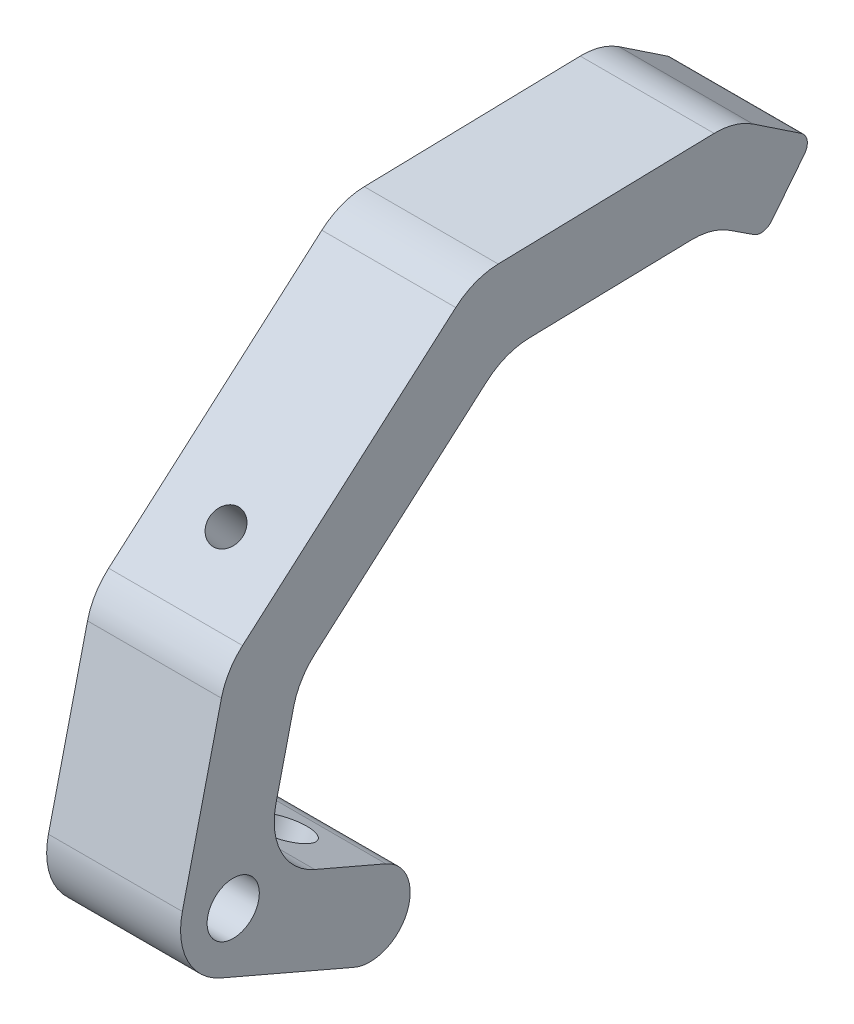
ISO-10303-21;
HEADER;
FILE_DESCRIPTION(('STEP AP214'),'2;1');
FILE_NAME('part.step','',(''),(''),'','','');
FILE_SCHEMA(('AUTOMOTIVE_DESIGN { 1 0 10303 214 1 1 1 1 }'));
ENDSEC;
DATA;
#1=APPLICATION_CONTEXT('core data for automotive mechanical design processes');
#2=APPLICATION_PROTOCOL_DEFINITION('international standard','automotive_design',2000,#1);
#3=PRODUCT_CONTEXT('',#1,'mechanical');
#4=PRODUCT('Part','Part','',(#3));
#5=PRODUCT_RELATED_PRODUCT_CATEGORY('part','',(#4));
#6=PRODUCT_DEFINITION_FORMATION('','',#4);
#7=PRODUCT_DEFINITION_CONTEXT('part definition',#1,'design');
#8=PRODUCT_DEFINITION('design','',#6,#7);
#9=PRODUCT_DEFINITION_SHAPE('','',#8);
#10=(LENGTH_UNIT() NAMED_UNIT(*) SI_UNIT(.MILLI.,.METRE.));
#11=(NAMED_UNIT(*) PLANE_ANGLE_UNIT() SI_UNIT($,.RADIAN.));
#12=(NAMED_UNIT(*) SI_UNIT($,.STERADIAN.) SOLID_ANGLE_UNIT());
#13=UNCERTAINTY_MEASURE_WITH_UNIT(LENGTH_MEASURE(1.E-05),#10,'distance_accuracy_value','');
#14=(GEOMETRIC_REPRESENTATION_CONTEXT(3) GLOBAL_UNCERTAINTY_ASSIGNED_CONTEXT((#13)) GLOBAL_UNIT_ASSIGNED_CONTEXT((#10,
#11,#12)) REPRESENTATION_CONTEXT('',''));
#15=CARTESIAN_POINT('',(0.,0.,0.));
#16=DIRECTION('',(0.,0.,1.));
#17=DIRECTION('',(1.,0.,0.));
#18=AXIS2_PLACEMENT_3D('',#15,#16,#17);
#19=CARTESIAN_POINT('',(25.4,-12.5585958310369,-29.1606613565719));
#20=DIRECTION('',(1.,0.,0.));
#21=DIRECTION('',(0.,0.,-1.));
#22=AXIS2_PLACEMENT_3D('',#19,#20,#21);
#23=PLANE('',#22);
#24=DIRECTION('',(0.,0.784049578849824,-0.620698201951169));
#25=VECTOR('',#24,1.);
#26=CARTESIAN_POINT('',(25.4,61.637766496689,-103.90188664107));
#27=LINE('',#26,#25);
#28=CARTESIAN_POINT('',(25.4,63.4548561776263,-105.340398092599));
#29=VERTEX_POINT('',#28);
#30=CARTESIAN_POINT('',(25.4,71.3247294522191,-111.570636999543));
#31=VERTEX_POINT('',#30);
#32=EDGE_CURVE('E244',#29,#31,#27,.T.);
#33=ORIENTED_EDGE('',*,*,#32,.T.);
#34=CARTESIAN_POINT('',(25.4,72.9013028851751,-109.579151069265));
#35=DIRECTION('',(1.,0.,0.));
#36=DIRECTION('',(0.,0.,-1.));
#37=AXIS2_PLACEMENT_3D('',#34,#35,#36);
#38=CIRCLE('',#37,2.54);
#39=CARTESIAN_POINT('',(25.4,75.0132522862397,-110.990274638391));
#40=VERTEX_POINT('',#39);
#41=EDGE_CURVE('E50',#31,#40,#38,.T.);
#42=ORIENTED_EDGE('',*,*,#41,.T.);
#43=DIRECTION('',(0.,0.555560460285814,0.831476142151424));
#44=VECTOR('',#43,1.);
#45=CARTESIAN_POINT('',(25.4,83.3912767020047,-98.451355982288));
#46=LINE('',#45,#44);
#47=CARTESIAN_POINT('',(25.4,81.1592530919545,-101.791900375099));
#48=VERTEX_POINT('',#47);
#49=EDGE_CURVE('E290',#40,#48,#46,.T.);
#50=ORIENTED_EDGE('',*,*,#49,.T.);
#51=CARTESIAN_POINT('',(25.4,70.5995060866314,-94.7362825294694));
#52=DIRECTION('',(1.,0.,0.));
#53=DIRECTION('',(0.,0.,-1.));
#54=AXIS2_PLACEMENT_3D('',#51,#52,#53);
#55=CIRCLE('',#54,12.7);
#56=CARTESIAN_POINT('',(25.4,83.2959290802973,-94.4348805289583));
#57=VERTEX_POINT('',#56);
#58=EDGE_CURVE('E335',#48,#57,#55,.T.);
#59=ORIENTED_EDGE('',*,*,#58,.T.);
#60=DIRECTION('',(0.,-0.0237324409851219,0.999718345957944));
#61=VECTOR('',#60,1.);
#62=CARTESIAN_POINT('',(25.4,82.2145560500137,-48.8825305673002));
#63=LINE('',#62,#61);
#64=CARTESIAN_POINT('',(25.4,82.3235432258102,-53.473566069559));
#65=VERTEX_POINT('',#64);
#66=EDGE_CURVE('E425',#57,#65,#63,.T.);
#67=ORIENTED_EDGE('',*,*,#66,.T.);
#68=CARTESIAN_POINT('',(25.4,69.6271202321443,-53.7749680700701));
#69=DIRECTION('',(1.,0.,0.));
#70=DIRECTION('',(0.,0.,-1.));
#71=AXIS2_PLACEMENT_3D('',#68,#69,#70);
#72=CIRCLE('',#71,12.7);
#73=CARTESIAN_POINT('',(25.4,79.194467979766,-45.4229708792133));
#74=VERTEX_POINT('',#73);
#75=EDGE_CURVE('E332',#65,#74,#72,.T.);
#76=ORIENTED_EDGE('',*,*,#75,.T.);
#77=DIRECTION('',(0.,-0.65763757408321,0.753334468316664));
#78=VECTOR('',#77,1.);
#79=CARTESIAN_POINT('',(25.4,41.2105608090452,-1.91179140785317));
#80=LINE('',#79,#78);
#81=CARTESIAN_POINT('',(25.4,43.8904858756525,-4.98168887834908));
#82=VERTEX_POINT('',#81);
#83=EDGE_CURVE('E532',#74,#82,#80,.T.);
#84=ORIENTED_EDGE('',*,*,#83,.T.);
#85=CARTESIAN_POINT('',(25.4,34.3231381280309,-13.3336860692058));
#86=DIRECTION('',(1.,0.,0.));
#87=DIRECTION('',(0.,0.,-1.));
#88=AXIS2_PLACEMENT_3D('',#85,#86,#87);
#89=CIRCLE('',#88,12.7);
#90=CARTESIAN_POINT('',(25.4,37.2447808629191,-0.974317002393628));
#91=VERTEX_POINT('',#90);
#92=EDGE_CURVE('E329',#82,#91,#89,.T.);
#93=ORIENTED_EDGE('',*,*,#92,.T.);
#94=DIRECTION('',(0.,-0.973178666678127,0.23005060904632));
#95=VECTOR('',#94,1.);
#96=CARTESIAN_POINT('',(25.4,-4.46945957439463,8.88655104485323));
#97=LINE('',#96,#95);
#98=CARTESIAN_POINT('',(25.4,5.90128245115134,6.43500170357673));
#99=VERTEX_POINT('',#98);
#100=EDGE_CURVE('E206',#91,#99,#97,.T.);
#101=ORIENTED_EDGE('',*,*,#100,.T.);
#102=CARTESIAN_POINT('',(25.4,2.97963971626309,-5.92436736323549));
#103=DIRECTION('',(1.,0.,0.));
#104=DIRECTION('',(0.,0.,-1.));
#105=AXIS2_PLACEMENT_3D('',#102,#103,#104);
#106=CIRCLE('',#105,12.7);
#107=CARTESIAN_POINT('',(25.4,-8.68462482636565,-0.90092903082073));
#108=VERTEX_POINT('',#107);
#109=EDGE_CURVE('E201',#99,#108,#106,.T.);
#110=ORIENTED_EDGE('',*,*,#109,.T.);
#111=DIRECTION('',(0.,-0.395546325386989,-0.918446026978641));
#112=VECTOR('',#111,1.);
#113=CARTESIAN_POINT('',(25.4,-4.46945957439463,8.88655104485323));
#114=LINE('',#113,#112);
#115=CARTESIAN_POINT('',(25.4,-19.5571545566141,-26.146598357123));
#116=VERTEX_POINT('',#115);
#117=EDGE_CURVE('E192',#108,#116,#114,.T.);
#118=ORIENTED_EDGE('',*,*,#117,.T.);
#119=CARTESIAN_POINT('',(25.4,-12.5585958310369,-29.1606613565719));
#120=DIRECTION('',(1.,0.,0.));
#121=DIRECTION('',(0.,0.,-1.));
#122=AXIS2_PLACEMENT_3D('',#119,#120,#121);
#123=CIRCLE('',#122,7.62);
#124=CARTESIAN_POINT('',(25.4,-5.56003710545966,-32.1747243560207));
#125=VERTEX_POINT('',#124);
#126=EDGE_CURVE('E197',#116,#125,#123,.T.);
#127=ORIENTED_EDGE('',*,*,#126,.T.);
#128=DIRECTION('',(0.,0.395546325386989,0.918446026978641));
#129=VECTOR('',#128,1.);
#130=CARTESIAN_POINT('',(25.4,4.46945957439463,-8.88655104485323));
#131=LINE('',#130,#129);
#132=CARTESIAN_POINT('',(25.4,0.25429432242361,-18.6740311205272));
#133=VERTEX_POINT('',#132);
#134=EDGE_CURVE('E223',#125,#133,#131,.T.);
#135=ORIENTED_EDGE('',*,*,#134,.T.);
#136=CARTESIAN_POINT('',(25.4,11.9185588650523,-23.697469452942));
#137=DIRECTION('',(1.,0.,0.));
#138=DIRECTION('',(0.,0.,-1.));
#139=AXIS2_PLACEMENT_3D('',#136,#137,#138);
#140=CIRCLE('',#139,12.7);
#141=CARTESIAN_POINT('',(25.4,14.8402015999406,-11.3381003861297));
#142=VERTEX_POINT('',#141);
#143=EDGE_CURVE('E393',#133,#142,#140,.F.);
#144=ORIENTED_EDGE('',*,*,#143,.T.);
#145=DIRECTION('',(0.,0.973178666678127,-0.230050609046319));
#146=VECTOR('',#145,1.);
#147=CARTESIAN_POINT('',(25.4,4.46945957439463,-8.88655104485323));
#148=LINE('',#147,#146);
#149=CARTESIAN_POINT('',(25.4,28.979873645702,-14.6805905960168));
#150=VERTEX_POINT('',#149);
#151=EDGE_CURVE('E226',#142,#150,#148,.T.);
#152=ORIENTED_EDGE('',*,*,#151,.T.);
#153=CARTESIAN_POINT('',(25.4,26.0582309108137,-27.0399596628291));
#154=DIRECTION('',(1.,0.,0.));
#155=DIRECTION('',(0.,0.,-1.));
#156=AXIS2_PLACEMENT_3D('',#153,#154,#155);
#157=CIRCLE('',#156,12.7);
#158=CARTESIAN_POINT('',(25.4,35.6255786584354,-18.6879624719723));
#159=VERTEX_POINT('',#158);
#160=EDGE_CURVE('E387',#150,#159,#157,.F.);
#161=ORIENTED_EDGE('',*,*,#160,.T.);
#162=DIRECTION('',(0.,0.65763757408321,-0.753334468316664));
#163=VECTOR('',#162,1.);
#164=CARTESIAN_POINT('',(25.4,32.945653591828,-15.6180650014764));
#165=LINE('',#164,#163);
#166=CARTESIAN_POINT('',(25.4,64.0895449983228,-51.2938958825371));
#167=VERTEX_POINT('',#166);
#168=EDGE_CURVE('E233',#159,#167,#165,.T.);
#169=ORIENTED_EDGE('',*,*,#168,.T.);
#170=CARTESIAN_POINT('',(25.4,54.5221972507011,-59.6458930733938));
#171=DIRECTION('',(1.,0.,0.));
#172=DIRECTION('',(0.,0.,-1.));
#173=AXIS2_PLACEMENT_3D('',#170,#171,#172);
#174=CIRCLE('',#173,12.7);
#175=CARTESIAN_POINT('',(25.4,67.218620244367,-59.3444910728828));
#176=VERTEX_POINT('',#175);
#177=EDGE_CURVE('E381',#167,#176,#174,.F.);
#178=ORIENTED_EDGE('',*,*,#177,.T.);
#179=DIRECTION('',(0.,0.0237324409851224,-0.999718345957944));
#180=VECTOR('',#179,1.);
#181=CARTESIAN_POINT('',(25.4,67.1096330685705,-54.753455570624));
#182=LINE('',#181,#180);
#183=CARTESIAN_POINT('',(25.4,67.9497805882237,-90.1442899662488));
#184=VERTEX_POINT('',#183);
#185=EDGE_CURVE('E237',#176,#184,#182,.T.);
#186=ORIENTED_EDGE('',*,*,#185,.T.);
#187=CARTESIAN_POINT('',(25.4,55.2533575945578,-90.4456919667599));
#188=DIRECTION('',(1.,0.,0.));
#189=DIRECTION('',(0.,0.,-1.));
#190=AXIS2_PLACEMENT_3D('',#187,#188,#189);
#191=CIRCLE('',#190,12.7);
#192=CARTESIAN_POINT('',(25.4,65.8895268550452,-97.3855697367399));
#193=VERTEX_POINT('',#192);
#194=EDGE_CURVE('E375',#184,#193,#191,.F.);
#195=ORIENTED_EDGE('',*,*,#194,.T.);
#196=DIRECTION('',(0.,-0.546447068502364,-0.837493642558063));
#197=VECTOR('',#196,1.);
#198=CARTESIAN_POINT('',(25.4,68.0433208252155,-94.0846301556363));
#199=LINE('',#198,#197);
#200=CARTESIAN_POINT('',(25.4,62.9041957584848,-101.960936608324));
#201=VERTEX_POINT('',#200);
#202=EDGE_CURVE('E241',#193,#201,#199,.T.);
#203=ORIENTED_EDGE('',*,*,#202,.T.);
#204=CARTESIAN_POINT('',(25.4,65.0314296105823,-103.34891216232));
#205=DIRECTION('',(1.,0.,0.));
#206=DIRECTION('',(0.,0.,-1.));
#207=AXIS2_PLACEMENT_3D('',#204,#205,#206);
#208=CIRCLE('',#207,2.54);
#209=EDGE_CURVE('E412',#201,#29,#208,.T.);
#210=ORIENTED_EDGE('',*,*,#209,.T.);
#211=EDGE_LOOP('',(#33,#42,#50,#59,#67,#76,#84,#93,#101,#110,#118,#127,#135,#144,#152,#161,#169,
#178,#186,#195,#203,#210));
#212=FACE_BOUND('',#211,.T.);
#213=CARTESIAN_POINT('',(25.4,1.61628901546969,-3.21364017285075));
#214=DIRECTION('',(1.,0.,0.));
#215=DIRECTION('',(0.,0.,-1.));
#216=AXIS2_PLACEMENT_3D('',#213,#214,#215);
#217=CIRCLE('',#216,4.953);
#218=CARTESIAN_POINT('',(25.4,1.61628901546969,-8.16664017285075));
#219=VERTEX_POINT('',#218);
#220=EDGE_CURVE('E251',#219,#219,#217,.T.);
#221=ORIENTED_EDGE('',*,*,#220,.F.);
#222=EDGE_LOOP('',(#221));
#223=FACE_BOUND('',#222,.T.);
#224=ADVANCED_FACE('F41',(#212,#223),#23,.T.);
#225=CARTESIAN_POINT('',(0.,-12.5585958310369,-29.1606613565719));
#226=DIRECTION('',(1.,0.,0.));
#227=DIRECTION('',(0.,0.,-1.));
#228=AXIS2_PLACEMENT_3D('',#225,#226,#227);
#229=PLANE('',#228);
#230=DIRECTION('',(0.,0.555560460285814,0.831476142151424));
#231=VECTOR('',#230,1.);
#232=CARTESIAN_POINT('',(0.,83.3912767020047,-98.451355982288));
#233=LINE('',#232,#231);
#234=CARTESIAN_POINT('',(0.,75.0132522862397,-110.990274638391));
#235=VERTEX_POINT('',#234);
#236=CARTESIAN_POINT('',(0.,81.1592530919545,-101.791900375099));
#237=VERTEX_POINT('',#236);
#238=EDGE_CURVE('E247',#235,#237,#233,.T.);
#239=ORIENTED_EDGE('',*,*,#238,.F.);
#240=CARTESIAN_POINT('',(0.,72.9013028851751,-109.579151069265));
#241=DIRECTION('',(1.,0.,0.));
#242=DIRECTION('',(0.,0.,-1.));
#243=AXIS2_PLACEMENT_3D('',#240,#241,#242);
#244=CIRCLE('',#243,2.54);
#245=CARTESIAN_POINT('',(0.,71.3247294522191,-111.570636999543));
#246=VERTEX_POINT('',#245);
#247=EDGE_CURVE('E403',#235,#246,#244,.F.);
#248=ORIENTED_EDGE('',*,*,#247,.T.);
#249=DIRECTION('',(0.,0.784049578849824,-0.620698201951169));
#250=VECTOR('',#249,1.);
#251=CARTESIAN_POINT('',(0.,61.637766496689,-103.90188664107));
#252=LINE('',#251,#250);
#253=CARTESIAN_POINT('',(0.,63.4548561776263,-105.340398092599));
#254=VERTEX_POINT('',#253);
#255=EDGE_CURVE('E287',#254,#246,#252,.T.);
#256=ORIENTED_EDGE('',*,*,#255,.F.);
#257=CARTESIAN_POINT('',(0.,65.0314296105823,-103.34891216232));
#258=DIRECTION('',(1.,0.,0.));
#259=DIRECTION('',(0.,0.,-1.));
#260=AXIS2_PLACEMENT_3D('',#257,#258,#259);
#261=CIRCLE('',#260,2.54);
#262=CARTESIAN_POINT('',(0.,62.9041957584848,-101.960936608324));
#263=VERTEX_POINT('',#262);
#264=EDGE_CURVE('E400',#254,#263,#261,.F.);
#265=ORIENTED_EDGE('',*,*,#264,.T.);
#266=DIRECTION('',(0.,-0.546447068502364,-0.837493642558063));
#267=VECTOR('',#266,1.);
#268=CARTESIAN_POINT('',(0.,68.0433208252155,-94.0846301556363));
#269=LINE('',#268,#267);
#270=CARTESIAN_POINT('',(0.,65.8895268550452,-97.3855697367399));
#271=VERTEX_POINT('',#270);
#272=EDGE_CURVE('E284',#271,#263,#269,.T.);
#273=ORIENTED_EDGE('',*,*,#272,.F.);
#274=CARTESIAN_POINT('',(0.,55.2533575945578,-90.4456919667599));
#275=DIRECTION('',(1.,0.,0.));
#276=DIRECTION('',(0.,0.,-1.));
#277=AXIS2_PLACEMENT_3D('',#274,#275,#276);
#278=CIRCLE('',#277,12.7);
#279=CARTESIAN_POINT('',(0.,67.9497805882237,-90.1442899662488));
#280=VERTEX_POINT('',#279);
#281=EDGE_CURVE('E372',#271,#280,#278,.T.);
#282=ORIENTED_EDGE('',*,*,#281,.T.);
#283=DIRECTION('',(0.,0.0237324409851224,-0.999718345957944));
#284=VECTOR('',#283,1.);
#285=CARTESIAN_POINT('',(0.,67.1096330685705,-54.753455570624));
#286=LINE('',#285,#284);
#287=CARTESIAN_POINT('',(0.,67.218620244367,-59.3444910728828));
#288=VERTEX_POINT('',#287);
#289=EDGE_CURVE('E280',#288,#280,#286,.T.);
#290=ORIENTED_EDGE('',*,*,#289,.F.);
#291=CARTESIAN_POINT('',(0.,54.5221972507011,-59.6458930733938));
#292=DIRECTION('',(1.,0.,0.));
#293=DIRECTION('',(0.,0.,-1.));
#294=AXIS2_PLACEMENT_3D('',#291,#292,#293);
#295=CIRCLE('',#294,12.7);
#296=CARTESIAN_POINT('',(0.,64.0895449983228,-51.2938958825371));
#297=VERTEX_POINT('',#296);
#298=EDGE_CURVE('E378',#288,#297,#295,.T.);
#299=ORIENTED_EDGE('',*,*,#298,.T.);
#300=DIRECTION('',(0.,0.65763757408321,-0.753334468316664));
#301=VECTOR('',#300,1.);
#302=CARTESIAN_POINT('',(0.,32.945653591828,-15.6180650014764));
#303=LINE('',#302,#301);
#304=CARTESIAN_POINT('',(0.,35.6255786584354,-18.6879624719723));
#305=VERTEX_POINT('',#304);
#306=EDGE_CURVE('E276',#305,#297,#303,.T.);
#307=ORIENTED_EDGE('',*,*,#306,.F.);
#308=CARTESIAN_POINT('',(0.,26.0582309108137,-27.0399596628291));
#309=DIRECTION('',(1.,0.,0.));
#310=DIRECTION('',(0.,0.,-1.));
#311=AXIS2_PLACEMENT_3D('',#308,#309,#310);
#312=CIRCLE('',#311,12.7);
#313=CARTESIAN_POINT('',(0.,28.979873645702,-14.6805905960168));
#314=VERTEX_POINT('',#313);
#315=EDGE_CURVE('E384',#305,#314,#312,.T.);
#316=ORIENTED_EDGE('',*,*,#315,.T.);
#317=DIRECTION('',(0.,0.973178666678127,-0.230050609046319));
#318=VECTOR('',#317,1.);
#319=CARTESIAN_POINT('',(0.,4.46945957439463,-8.88655104485323));
#320=LINE('',#319,#318);
#321=CARTESIAN_POINT('',(0.,14.8402015999406,-11.3381003861297));
#322=VERTEX_POINT('',#321);
#323=EDGE_CURVE('E272',#322,#314,#320,.T.);
#324=ORIENTED_EDGE('',*,*,#323,.F.);
#325=CARTESIAN_POINT('',(0.,11.9185588650523,-23.697469452942));
#326=DIRECTION('',(1.,0.,0.));
#327=DIRECTION('',(0.,0.,-1.));
#328=AXIS2_PLACEMENT_3D('',#325,#326,#327);
#329=CIRCLE('',#328,12.7);
#330=CARTESIAN_POINT('',(0.,0.25429432242361,-18.6740311205272));
#331=VERTEX_POINT('',#330);
#332=EDGE_CURVE('E390',#322,#331,#329,.T.);
#333=ORIENTED_EDGE('',*,*,#332,.T.);
#334=DIRECTION('',(0.,0.395546325386989,0.918446026978641));
#335=VECTOR('',#334,1.);
#336=CARTESIAN_POINT('',(0.,4.46945957439463,-8.88655104485323));
#337=LINE('',#336,#335);
#338=CARTESIAN_POINT('',(0.,-5.56003710545966,-32.1747243560207));
#339=VERTEX_POINT('',#338);
#340=EDGE_CURVE('E268',#339,#331,#337,.T.);
#341=ORIENTED_EDGE('',*,*,#340,.F.);
#342=CARTESIAN_POINT('',(0.,-12.5585958310369,-29.1606613565719));
#343=DIRECTION('',(1.,0.,0.));
#344=DIRECTION('',(0.,0.,-1.));
#345=AXIS2_PLACEMENT_3D('',#342,#343,#344);
#346=CIRCLE('',#345,7.62);
#347=CARTESIAN_POINT('',(0.,-19.5571545566141,-26.146598357123));
#348=VERTEX_POINT('',#347);
#349=EDGE_CURVE('E265',#348,#339,#346,.T.);
#350=ORIENTED_EDGE('',*,*,#349,.F.);
#351=DIRECTION('',(0.,-0.395546325386989,-0.918446026978641));
#352=VECTOR('',#351,1.);
#353=CARTESIAN_POINT('',(0.,-4.46945957439463,8.88655104485323));
#354=LINE('',#353,#352);
#355=CARTESIAN_POINT('',(0.,-8.68462482636565,-0.90092903082073));
#356=VERTEX_POINT('',#355);
#357=EDGE_CURVE('E212',#356,#348,#354,.T.);
#358=ORIENTED_EDGE('',*,*,#357,.F.);
#359=CARTESIAN_POINT('',(0.,2.97963971626309,-5.92436736323549));
#360=DIRECTION('',(1.,0.,0.));
#361=DIRECTION('',(0.,0.,-1.));
#362=AXIS2_PLACEMENT_3D('',#359,#360,#361);
#363=CIRCLE('',#362,12.7);
#364=CARTESIAN_POINT('',(0.,5.90128245115134,6.43500170357673));
#365=VERTEX_POINT('',#364);
#366=EDGE_CURVE('E310',#356,#365,#363,.F.);
#367=ORIENTED_EDGE('',*,*,#366,.T.);
#368=DIRECTION('',(0.,-0.973178666678127,0.23005060904632));
#369=VECTOR('',#368,1.);
#370=CARTESIAN_POINT('',(0.,-4.46945957439463,8.88655104485323));
#371=LINE('',#370,#369);
#372=CARTESIAN_POINT('',(0.,37.2447808629191,-0.974317002393628));
#373=VERTEX_POINT('',#372);
#374=EDGE_CURVE('E259',#373,#365,#371,.T.);
#375=ORIENTED_EDGE('',*,*,#374,.F.);
#376=CARTESIAN_POINT('',(0.,34.3231381280309,-13.3336860692058));
#377=DIRECTION('',(1.,0.,0.));
#378=DIRECTION('',(0.,0.,-1.));
#379=AXIS2_PLACEMENT_3D('',#376,#377,#378);
#380=CIRCLE('',#379,12.7);
#381=CARTESIAN_POINT('',(0.,43.8904858756525,-4.98168887834908));
#382=VERTEX_POINT('',#381);
#383=EDGE_CURVE('E313',#373,#382,#380,.F.);
#384=ORIENTED_EDGE('',*,*,#383,.T.);
#385=DIRECTION('',(0.,-0.65763757408321,0.753334468316664));
#386=VECTOR('',#385,1.);
#387=CARTESIAN_POINT('',(0.,41.2105608090452,-1.91179140785317));
#388=LINE('',#387,#386);
#389=CARTESIAN_POINT('',(0.,79.194467979766,-45.4229708792133));
#390=VERTEX_POINT('',#389);
#391=EDGE_CURVE('E255',#390,#382,#388,.T.);
#392=ORIENTED_EDGE('',*,*,#391,.F.);
#393=CARTESIAN_POINT('',(0.,69.6271202321443,-53.7749680700701));
#394=DIRECTION('',(1.,0.,0.));
#395=DIRECTION('',(0.,0.,-1.));
#396=AXIS2_PLACEMENT_3D('',#393,#394,#395);
#397=CIRCLE('',#396,12.7);
#398=CARTESIAN_POINT('',(0.,82.3235432258102,-53.473566069559));
#399=VERTEX_POINT('',#398);
#400=EDGE_CURVE('E316',#390,#399,#397,.F.);
#401=ORIENTED_EDGE('',*,*,#400,.T.);
#402=DIRECTION('',(0.,-0.0237324409851219,0.999718345957944));
#403=VECTOR('',#402,1.);
#404=CARTESIAN_POINT('',(0.,82.2145560500137,-48.8825305673002));
#405=LINE('',#404,#403);
#406=CARTESIAN_POINT('',(0.,83.2959290802973,-94.4348805289583));
#407=VERTEX_POINT('',#406);
#408=EDGE_CURVE('E250',#407,#399,#405,.T.);
#409=ORIENTED_EDGE('',*,*,#408,.F.);
#410=CARTESIAN_POINT('',(0.,70.5995060866314,-94.7362825294694));
#411=DIRECTION('',(1.,0.,0.));
#412=DIRECTION('',(0.,0.,-1.));
#413=AXIS2_PLACEMENT_3D('',#410,#411,#412);
#414=CIRCLE('',#413,12.7);
#415=EDGE_CURVE('E319',#407,#237,#414,.F.);
#416=ORIENTED_EDGE('',*,*,#415,.T.);
#417=EDGE_LOOP('',(#239,#248,#256,#265,#273,#282,#290,#299,#307,#316,#324,#333,#341,#350,#358,
#367,#375,#384,#392,#401,#409,#416));
#418=FACE_BOUND('',#417,.T.);
#419=CARTESIAN_POINT('',(0.,1.61628901546969,-3.21364017285075));
#420=DIRECTION('',(1.,0.,0.));
#421=DIRECTION('',(0.,0.,-1.));
#422=AXIS2_PLACEMENT_3D('',#419,#420,#421);
#423=CIRCLE('',#422,4.953);
#424=CARTESIAN_POINT('',(0.,1.61628901546969,-8.16664017285075));
#425=VERTEX_POINT('',#424);
#426=EDGE_CURVE('E522',#425,#425,#423,.T.);
#427=ORIENTED_EDGE('',*,*,#426,.T.);
#428=EDGE_LOOP('',(#427));
#429=FACE_BOUND('',#428,.T.);
#430=ADVANCED_FACE('F430',(#418,#429),#229,.F.);
#431=CARTESIAN_POINT('',(25.4,83.3912767020047,-98.451355982288));
#432=DIRECTION('',(0.,-0.831476142151424,0.555560460285814));
#433=DIRECTION('',(0.,-0.555560460285814,-0.831476142151424));
#434=AXIS2_PLACEMENT_3D('',#431,#432,#433);
#435=PLANE('',#434);
#436=ORIENTED_EDGE('',*,*,#49,.F.);
#437=DIRECTION('',(-1.,0.,0.));
#438=VECTOR('',#437,1.);
#439=CARTESIAN_POINT('',(25.4,75.0132522862397,-110.990274638391));
#440=LINE('',#439,#438);
#441=EDGE_CURVE('E396',#40,#235,#440,.T.);
#442=ORIENTED_EDGE('',*,*,#441,.T.);
#443=ORIENTED_EDGE('',*,*,#238,.T.);
#444=DIRECTION('',(-1.,0.,0.));
#445=VECTOR('',#444,1.);
#446=CARTESIAN_POINT('',(25.4,81.1592530919545,-101.791900375099));
#447=LINE('',#446,#445);
#448=EDGE_CURVE('E323',#237,#48,#447,.F.);
#449=ORIENTED_EDGE('',*,*,#448,.T.);
#450=EDGE_LOOP('',(#436,#442,#443,#449));
#451=FACE_BOUND('',#450,.T.);
#452=ADVANCED_FACE('F420',(#451),#435,.F.);
#453=CARTESIAN_POINT('',(25.4,82.2145560500137,-48.8825305673002));
#454=DIRECTION('',(0.,-0.999718345957944,-0.0237324409851219));
#455=DIRECTION('',(0.,0.0237324409851219,-0.999718345957944));
#456=AXIS2_PLACEMENT_3D('',#453,#454,#455);
#457=PLANE('',#456);
#458=ORIENTED_EDGE('',*,*,#66,.F.);
#459=DIRECTION('',(-1.,0.,0.));
#460=VECTOR('',#459,1.);
#461=CARTESIAN_POINT('',(25.4,83.2959290802973,-94.4348805289584));
#462=LINE('',#461,#460);
#463=EDGE_CURVE('E306',#57,#407,#462,.T.);
#464=ORIENTED_EDGE('',*,*,#463,.T.);
#465=ORIENTED_EDGE('',*,*,#408,.T.);
#466=DIRECTION('',(-1.,0.,0.));
#467=VECTOR('',#466,1.);
#468=CARTESIAN_POINT('',(25.4,82.3235432258102,-53.473566069559));
#469=LINE('',#468,#467);
#470=EDGE_CURVE('E303',#399,#65,#469,.F.);
#471=ORIENTED_EDGE('',*,*,#470,.T.);
#472=EDGE_LOOP('',(#458,#464,#465,#471));
#473=FACE_BOUND('',#472,.T.);
#474=ADVANCED_FACE('F560',(#473),#457,.F.);
#475=CARTESIAN_POINT('',(25.4,41.2105608090452,-1.91179140785317));
#476=DIRECTION('',(0.,-0.753334468316664,-0.65763757408321));
#477=DIRECTION('',(0.,0.65763757408321,-0.753334468316664));
#478=AXIS2_PLACEMENT_3D('',#475,#476,#477);
#479=PLANE('',#478);
#480=CARTESIAN_POINT('',(12.7,52.2424830665093,-14.5490366259707));
#481=DIRECTION('',(0.,0.753334468316664,0.65763757408321));
#482=DIRECTION('',(0.,-0.65763757408321,0.753334468316664));
#483=AXIS2_PLACEMENT_3D('',#480,#481,#482);
#484=CIRCLE('',#483,3.175);
#485=CARTESIAN_POINT('',(12.7,50.1544837687951,-12.1571996890653));
#486=VERTEX_POINT('',#485);
#487=EDGE_CURVE('E509',#486,#486,#484,.T.);
#488=ORIENTED_EDGE('',*,*,#487,.F.);
#489=EDGE_LOOP('',(#488));
#490=FACE_BOUND('',#489,.T.);
#491=ORIENTED_EDGE('',*,*,#83,.F.);
#492=DIRECTION('',(-1.,0.,0.));
#493=VECTOR('',#492,1.);
#494=CARTESIAN_POINT('',(25.4,79.194467979766,-45.4229708792133));
#495=LINE('',#494,#493);
#496=EDGE_CURVE('E358',#74,#390,#495,.T.);
#497=ORIENTED_EDGE('',*,*,#496,.T.);
#498=ORIENTED_EDGE('',*,*,#391,.T.);
#499=DIRECTION('',(-1.,0.,0.));
#500=VECTOR('',#499,1.);
#501=CARTESIAN_POINT('',(25.4,43.8904858756525,-4.98168887834908));
#502=LINE('',#501,#500);
#503=EDGE_CURVE('E355',#382,#82,#502,.F.);
#504=ORIENTED_EDGE('',*,*,#503,.T.);
#505=EDGE_LOOP('',(#491,#497,#498,#504));
#506=FACE_BOUND('',#505,.T.);
#507=ADVANCED_FACE('F551',(#490,#506),#479,.F.);
#508=CARTESIAN_POINT('',(25.4,-4.46945957439463,8.88655104485323));
#509=DIRECTION('',(0.,-0.23005060904632,-0.973178666678127));
#510=DIRECTION('',(0.,0.973178666678127,-0.23005060904632));
#511=AXIS2_PLACEMENT_3D('',#508,#509,#510);
#512=PLANE('',#511);
#513=ORIENTED_EDGE('',*,*,#100,.F.);
#514=DIRECTION('',(-1.,0.,0.));
#515=VECTOR('',#514,1.);
#516=CARTESIAN_POINT('',(25.4,37.2447808629192,-0.974317002393631));
#517=LINE('',#516,#515);
#518=EDGE_CURVE('E365',#91,#373,#517,.T.);
#519=ORIENTED_EDGE('',*,*,#518,.T.);
#520=ORIENTED_EDGE('',*,*,#374,.T.);
#521=DIRECTION('',(-1.,0.,0.));
#522=VECTOR('',#521,1.);
#523=CARTESIAN_POINT('',(25.4,5.90128245115135,6.43500170357672));
#524=LINE('',#523,#522);
#525=EDGE_CURVE('E362',#365,#99,#524,.F.);
#526=ORIENTED_EDGE('',*,*,#525,.T.);
#527=EDGE_LOOP('',(#513,#519,#520,#526));
#528=FACE_BOUND('',#527,.T.);
#529=ADVANCED_FACE('F544',(#528),#512,.F.);
#530=CARTESIAN_POINT('',(25.4,-4.46945957439463,8.88655104485323));
#531=DIRECTION('',(0.,0.918446026978641,-0.395546325386989));
#532=DIRECTION('',(0.,0.395546325386989,0.918446026978641));
#533=AXIS2_PLACEMENT_3D('',#530,#531,#532);
#534=PLANE('',#533);
#535=CARTESIAN_POINT('',(12.7,-16.5430915571653,-19.1480396315458));
#536=DIRECTION('',(0.,-0.918446026978641,0.395546325386989));
#537=DIRECTION('',(0.,-0.395546325386989,-0.918446026978641));
#538=AXIS2_PLACEMENT_3D('',#535,#536,#537);
#539=CIRCLE('',#538,5.08);
#540=CARTESIAN_POINT('',(12.7,-18.5524668901312,-23.8137454485973));
#541=VERTEX_POINT('',#540);
#542=EDGE_CURVE('E508',#541,#541,#539,.T.);
#543=ORIENTED_EDGE('',*,*,#542,.F.);
#544=EDGE_LOOP('',(#543));
#545=FACE_BOUND('',#544,.T.);
#546=ORIENTED_EDGE('',*,*,#117,.F.);
#547=DIRECTION('',(-1.,0.,0.));
#548=VECTOR('',#547,1.);
#549=CARTESIAN_POINT('',(25.4,-8.68462482636565,-0.900929030820728));
#550=LINE('',#549,#548);
#551=EDGE_CURVE('E369',#108,#356,#550,.T.);
#552=ORIENTED_EDGE('',*,*,#551,.T.);
#553=ORIENTED_EDGE('',*,*,#357,.T.);
#554=DIRECTION('',(-1.,0.,0.));
#555=VECTOR('',#554,1.);
#556=CARTESIAN_POINT('',(25.4,-19.5571545566141,-26.146598357123));
#557=LINE('',#556,#555);
#558=EDGE_CURVE('E209',#116,#348,#557,.T.);
#559=ORIENTED_EDGE('',*,*,#558,.F.);
#560=EDGE_LOOP('',(#546,#552,#553,#559));
#561=FACE_BOUND('',#560,.T.);
#562=ADVANCED_FACE('F210',(#545,#561),#534,.F.);
#563=CARTESIAN_POINT('',(25.4,-12.5585958310369,-29.1606613565719));
#564=DIRECTION('',(-1.,0.,0.));
#565=DIRECTION('',(0.,0.,1.));
#566=AXIS2_PLACEMENT_3D('',#563,#564,#565);
#567=CYLINDRICAL_SURFACE('',#566,7.62);
#568=ORIENTED_EDGE('',*,*,#349,.T.);
#569=DIRECTION('',(-1.,0.,0.));
#570=VECTOR('',#569,1.);
#571=CARTESIAN_POINT('',(25.4,-5.56003710545966,-32.1747243560207));
#572=LINE('',#571,#570);
#573=EDGE_CURVE('E217',#125,#339,#572,.T.);
#574=ORIENTED_EDGE('',*,*,#573,.F.);
#575=ORIENTED_EDGE('',*,*,#126,.F.);
#576=ORIENTED_EDGE('',*,*,#558,.T.);
#577=EDGE_LOOP('',(#568,#574,#575,#576));
#578=FACE_BOUND('',#577,.T.);
#579=ADVANCED_FACE('F219',(#578),#567,.T.);
#580=CARTESIAN_POINT('',(25.4,4.46945957439463,-8.88655104485323));
#581=DIRECTION('',(0.,-0.918446026978641,0.395546325386989));
#582=DIRECTION('',(0.,-0.395546325386989,-0.918446026978641));
#583=AXIS2_PLACEMENT_3D('',#580,#581,#582);
#584=PLANE('',#583);
#585=CARTESIAN_POINT('',(12.7,-2.5459741060108,-25.1761656304435));
#586=DIRECTION('',(0.,-0.918446026978641,0.395546325386989));
#587=DIRECTION('',(0.,-0.395546325386989,-0.918446026978641));
#588=AXIS2_PLACEMENT_3D('',#585,#586,#587);
#589=CIRCLE('',#588,5.08);
#590=CARTESIAN_POINT('',(12.7,-4.55534943897671,-29.841871447495));
#591=VERTEX_POINT('',#590);
#592=EDGE_CURVE('E514',#591,#591,#589,.F.);
#593=ORIENTED_EDGE('',*,*,#592,.F.);
#594=EDGE_LOOP('',(#593));
#595=FACE_BOUND('',#594,.T.);
#596=ORIENTED_EDGE('',*,*,#340,.T.);
#597=DIRECTION('',(-1.,0.,0.));
#598=VECTOR('',#597,1.);
#599=CARTESIAN_POINT('',(25.4,0.254294322423612,-18.6740311205272));
#600=LINE('',#599,#598);
#601=EDGE_CURVE('E352',#331,#133,#600,.F.);
#602=ORIENTED_EDGE('',*,*,#601,.T.);
#603=ORIENTED_EDGE('',*,*,#134,.F.);
#604=ORIENTED_EDGE('',*,*,#573,.T.);
#605=EDGE_LOOP('',(#596,#602,#603,#604));
#606=FACE_BOUND('',#605,.T.);
#607=ADVANCED_FACE('F472',(#595,#606),#584,.F.);
#608=CARTESIAN_POINT('',(25.4,4.46945957439463,-8.88655104485323));
#609=DIRECTION('',(0.,0.230050609046319,0.973178666678127));
#610=DIRECTION('',(0.,-0.973178666678127,0.230050609046319));
#611=AXIS2_PLACEMENT_3D('',#608,#609,#610);
#612=PLANE('',#611);
#613=ORIENTED_EDGE('',*,*,#323,.T.);
#614=DIRECTION('',(-1.,0.,0.));
#615=VECTOR('',#614,1.);
#616=CARTESIAN_POINT('',(25.4,28.979873645702,-14.6805905960168));
#617=LINE('',#616,#615);
#618=EDGE_CURVE('E349',#314,#150,#617,.F.);
#619=ORIENTED_EDGE('',*,*,#618,.T.);
#620=ORIENTED_EDGE('',*,*,#151,.F.);
#621=DIRECTION('',(-1.,0.,0.));
#622=VECTOR('',#621,1.);
#623=CARTESIAN_POINT('',(0.,14.8402015999406,-11.3381003861297));
#624=LINE('',#623,#622);
#625=EDGE_CURVE('E345',#142,#322,#624,.T.);
#626=ORIENTED_EDGE('',*,*,#625,.T.);
#627=EDGE_LOOP('',(#613,#619,#620,#626));
#628=FACE_BOUND('',#627,.T.);
#629=ADVANCED_FACE('F463',(#628),#612,.F.);
#630=CARTESIAN_POINT('',(25.4,32.945653591828,-15.6180650014764));
#631=DIRECTION('',(0.,0.753334468316664,0.65763757408321));
#632=DIRECTION('',(0.,-0.65763757408321,0.753334468316664));
#633=AXIS2_PLACEMENT_3D('',#630,#631,#632);
#634=PLANE('',#633);
#635=CARTESIAN_POINT('',(12.7,40.7616657693634,-24.5714332549988));
#636=DIRECTION('',(0.,0.753334468316664,0.65763757408321));
#637=DIRECTION('',(0.,-0.65763757408321,0.753334468316664));
#638=AXIS2_PLACEMENT_3D('',#635,#636,#637);
#639=CIRCLE('',#638,3.175);
#640=CARTESIAN_POINT('',(12.7,38.6736664716492,-22.1795963180934));
#641=VERTEX_POINT('',#640);
#642=EDGE_CURVE('E505',#641,#641,#639,.F.);
#643=ORIENTED_EDGE('',*,*,#642,.F.);
#644=EDGE_LOOP('',(#643));
#645=FACE_BOUND('',#644,.T.);
#646=ORIENTED_EDGE('',*,*,#306,.T.);
#647=DIRECTION('',(-1.,0.,0.));
#648=VECTOR('',#647,1.);
#649=CARTESIAN_POINT('',(25.4,64.0895449983228,-51.2938958825371));
#650=LINE('',#649,#648);
#651=EDGE_CURVE('E342',#297,#167,#650,.F.);
#652=ORIENTED_EDGE('',*,*,#651,.T.);
#653=ORIENTED_EDGE('',*,*,#168,.F.);
#654=DIRECTION('',(-1.,0.,0.));
#655=VECTOR('',#654,1.);
#656=CARTESIAN_POINT('',(0.,35.6255786584354,-18.6879624719723));
#657=LINE('',#656,#655);
#658=EDGE_CURVE('E338',#159,#305,#657,.T.);
#659=ORIENTED_EDGE('',*,*,#658,.T.);
#660=EDGE_LOOP('',(#646,#652,#653,#659));
#661=FACE_BOUND('',#660,.T.);
#662=ADVANCED_FACE('F454',(#645,#661),#634,.F.);
#663=CARTESIAN_POINT('',(25.4,67.1096330685705,-54.753455570624));
#664=DIRECTION('',(0.,0.999718345957944,0.0237324409851224));
#665=DIRECTION('',(0.,-0.0237324409851224,0.999718345957944));
#666=AXIS2_PLACEMENT_3D('',#663,#664,#665);
#667=PLANE('',#666);
#668=ORIENTED_EDGE('',*,*,#289,.T.);
#669=DIRECTION('',(-1.,0.,0.));
#670=VECTOR('',#669,1.);
#671=CARTESIAN_POINT('',(25.4,67.9497805882237,-90.1442899662488));
#672=LINE('',#671,#670);
#673=EDGE_CURVE('E300',#280,#184,#672,.F.);
#674=ORIENTED_EDGE('',*,*,#673,.T.);
#675=ORIENTED_EDGE('',*,*,#185,.F.);
#676=DIRECTION('',(-1.,0.,0.));
#677=VECTOR('',#676,1.);
#678=CARTESIAN_POINT('',(0.,67.218620244367,-59.3444910728828));
#679=LINE('',#678,#677);
#680=EDGE_CURVE('E296',#176,#288,#679,.T.);
#681=ORIENTED_EDGE('',*,*,#680,.T.);
#682=EDGE_LOOP('',(#668,#674,#675,#681));
#683=FACE_BOUND('',#682,.T.);
#684=ADVANCED_FACE('F445',(#683),#667,.F.);
#685=CARTESIAN_POINT('',(25.4,68.0433208252155,-94.0846301556363));
#686=DIRECTION('',(0.,0.837493642558063,-0.546447068502364));
#687=DIRECTION('',(0.,0.546447068502364,0.837493642558063));
#688=AXIS2_PLACEMENT_3D('',#685,#686,#687);
#689=PLANE('',#688);
#690=ORIENTED_EDGE('',*,*,#272,.T.);
#691=DIRECTION('',(-1.,0.,0.));
#692=VECTOR('',#691,1.);
#693=CARTESIAN_POINT('',(25.4,62.9041957584848,-101.960936608324));
#694=LINE('',#693,#692);
#695=EDGE_CURVE('E11',#263,#201,#694,.F.);
#696=ORIENTED_EDGE('',*,*,#695,.T.);
#697=ORIENTED_EDGE('',*,*,#202,.F.);
#698=DIRECTION('',(-1.,0.,0.));
#699=VECTOR('',#698,1.);
#700=CARTESIAN_POINT('',(0.,65.8895268550452,-97.3855697367399));
#701=LINE('',#700,#699);
#702=EDGE_CURVE('E216',#193,#271,#701,.T.);
#703=ORIENTED_EDGE('',*,*,#702,.T.);
#704=EDGE_LOOP('',(#690,#696,#697,#703));
#705=FACE_BOUND('',#704,.T.);
#706=ADVANCED_FACE('F437',(#705),#689,.F.);
#707=CARTESIAN_POINT('',(25.4,61.637766496689,-103.90188664107));
#708=DIRECTION('',(0.,0.620698201951169,0.784049578849824));
#709=DIRECTION('',(0.,-0.784049578849824,0.620698201951169));
#710=AXIS2_PLACEMENT_3D('',#707,#708,#709);
#711=PLANE('',#710);
#712=ORIENTED_EDGE('',*,*,#255,.T.);
#713=DIRECTION('',(-1.,0.,0.));
#714=VECTOR('',#713,1.);
#715=CARTESIAN_POINT('',(25.4,71.3247294522191,-111.570636999543));
#716=LINE('',#715,#714);
#717=EDGE_CURVE('E63',#246,#31,#716,.F.);
#718=ORIENTED_EDGE('',*,*,#717,.T.);
#719=ORIENTED_EDGE('',*,*,#32,.F.);
#720=DIRECTION('',(-1.,0.,0.));
#721=VECTOR('',#720,1.);
#722=CARTESIAN_POINT('',(25.4,63.4548561776263,-105.340398092599));
#723=LINE('',#722,#721);
#724=EDGE_CURVE('E406',#29,#254,#723,.T.);
#725=ORIENTED_EDGE('',*,*,#724,.T.);
#726=EDGE_LOOP('',(#712,#718,#719,#725));
#727=FACE_BOUND('',#726,.T.);
#728=ADVANCED_FACE('F432',(#727),#711,.F.);
#729=CARTESIAN_POINT('',(25.4,1.61628901546969,-3.21364017285075));
#730=DIRECTION('',(-1.,0.,0.));
#731=DIRECTION('',(0.,0.,1.));
#732=AXIS2_PLACEMENT_3D('',#729,#730,#731);
#733=CYLINDRICAL_SURFACE('',#732,4.953);
#734=ORIENTED_EDGE('',*,*,#220,.T.);
#735=EDGE_LOOP('',(#734));
#736=FACE_BOUND('',#735,.T.);
#737=ORIENTED_EDGE('',*,*,#426,.F.);
#738=EDGE_LOOP('',(#737));
#739=FACE_BOUND('',#738,.T.);
#740=ADVANCED_FACE('F490',(#736,#739),#733,.F.);
#741=CARTESIAN_POINT('',(25.4,55.2533575945578,-90.4456919667599));
#742=DIRECTION('',(1.,0.,0.));
#743=DIRECTION('',(0.,0.,-1.));
#744=AXIS2_PLACEMENT_3D('',#741,#742,#743);
#745=CYLINDRICAL_SURFACE('',#744,12.7);
#746=ORIENTED_EDGE('',*,*,#194,.F.);
#747=ORIENTED_EDGE('',*,*,#673,.F.);
#748=ORIENTED_EDGE('',*,*,#281,.F.);
#749=ORIENTED_EDGE('',*,*,#702,.F.);
#750=EDGE_LOOP('',(#746,#747,#748,#749));
#751=FACE_BOUND('',#750,.T.);
#752=ADVANCED_FACE('F441',(#751),#745,.F.);
#753=CARTESIAN_POINT('',(25.4,70.5995060866314,-94.7362825294694));
#754=DIRECTION('',(-1.,0.,0.));
#755=DIRECTION('',(0.,0.,1.));
#756=AXIS2_PLACEMENT_3D('',#753,#754,#755);
#757=CYLINDRICAL_SURFACE('',#756,12.7);
#758=ORIENTED_EDGE('',*,*,#58,.F.);
#759=ORIENTED_EDGE('',*,*,#448,.F.);
#760=ORIENTED_EDGE('',*,*,#415,.F.);
#761=ORIENTED_EDGE('',*,*,#463,.F.);
#762=EDGE_LOOP('',(#758,#759,#760,#761));
#763=FACE_BOUND('',#762,.T.);
#764=ADVANCED_FACE('F563',(#763),#757,.T.);
#765=CARTESIAN_POINT('',(25.4,54.5221972507011,-59.6458930733938));
#766=DIRECTION('',(1.,0.,0.));
#767=DIRECTION('',(0.,0.,-1.));
#768=AXIS2_PLACEMENT_3D('',#765,#766,#767);
#769=CYLINDRICAL_SURFACE('',#768,12.7);
#770=ORIENTED_EDGE('',*,*,#177,.F.);
#771=ORIENTED_EDGE('',*,*,#651,.F.);
#772=ORIENTED_EDGE('',*,*,#298,.F.);
#773=ORIENTED_EDGE('',*,*,#680,.F.);
#774=EDGE_LOOP('',(#770,#771,#772,#773));
#775=FACE_BOUND('',#774,.T.);
#776=ADVANCED_FACE('F450',(#775),#769,.F.);
#777=CARTESIAN_POINT('',(25.4,26.0582309108137,-27.0399596628291));
#778=DIRECTION('',(1.,0.,0.));
#779=DIRECTION('',(0.,0.,-1.));
#780=AXIS2_PLACEMENT_3D('',#777,#778,#779);
#781=CYLINDRICAL_SURFACE('',#780,12.7);
#782=ORIENTED_EDGE('',*,*,#160,.F.);
#783=ORIENTED_EDGE('',*,*,#618,.F.);
#784=ORIENTED_EDGE('',*,*,#315,.F.);
#785=ORIENTED_EDGE('',*,*,#658,.F.);
#786=EDGE_LOOP('',(#782,#783,#784,#785));
#787=FACE_BOUND('',#786,.T.);
#788=ADVANCED_FACE('F459',(#787),#781,.F.);
#789=CARTESIAN_POINT('',(25.4,11.9185588650523,-23.697469452942));
#790=DIRECTION('',(1.,0.,0.));
#791=DIRECTION('',(0.,0.,-1.));
#792=AXIS2_PLACEMENT_3D('',#789,#790,#791);
#793=CYLINDRICAL_SURFACE('',#792,12.7);
#794=ORIENTED_EDGE('',*,*,#143,.F.);
#795=ORIENTED_EDGE('',*,*,#601,.F.);
#796=ORIENTED_EDGE('',*,*,#332,.F.);
#797=ORIENTED_EDGE('',*,*,#625,.F.);
#798=EDGE_LOOP('',(#794,#795,#796,#797));
#799=FACE_BOUND('',#798,.T.);
#800=ADVANCED_FACE('F468',(#799),#793,.F.);
#801=CARTESIAN_POINT('',(25.4,69.6271202321443,-53.7749680700701));
#802=DIRECTION('',(-1.,0.,0.));
#803=DIRECTION('',(0.,0.,1.));
#804=AXIS2_PLACEMENT_3D('',#801,#802,#803);
#805=CYLINDRICAL_SURFACE('',#804,12.7);
#806=ORIENTED_EDGE('',*,*,#75,.F.);
#807=ORIENTED_EDGE('',*,*,#470,.F.);
#808=ORIENTED_EDGE('',*,*,#400,.F.);
#809=ORIENTED_EDGE('',*,*,#496,.F.);
#810=EDGE_LOOP('',(#806,#807,#808,#809));
#811=FACE_BOUND('',#810,.T.);
#812=ADVANCED_FACE('F555',(#811),#805,.T.);
#813=CARTESIAN_POINT('',(25.4,34.3231381280309,-13.3336860692058));
#814=DIRECTION('',(-1.,0.,0.));
#815=DIRECTION('',(0.,0.,1.));
#816=AXIS2_PLACEMENT_3D('',#813,#814,#815);
#817=CYLINDRICAL_SURFACE('',#816,12.7);
#818=ORIENTED_EDGE('',*,*,#92,.F.);
#819=ORIENTED_EDGE('',*,*,#503,.F.);
#820=ORIENTED_EDGE('',*,*,#383,.F.);
#821=ORIENTED_EDGE('',*,*,#518,.F.);
#822=EDGE_LOOP('',(#818,#819,#820,#821));
#823=FACE_BOUND('',#822,.T.);
#824=ADVANCED_FACE('F546',(#823),#817,.T.);
#825=CARTESIAN_POINT('',(25.4,2.97963971626309,-5.92436736323549));
#826=DIRECTION('',(-1.,0.,0.));
#827=DIRECTION('',(0.,0.,1.));
#828=AXIS2_PLACEMENT_3D('',#825,#826,#827);
#829=CYLINDRICAL_SURFACE('',#828,12.7);
#830=ORIENTED_EDGE('',*,*,#109,.F.);
#831=ORIENTED_EDGE('',*,*,#525,.F.);
#832=ORIENTED_EDGE('',*,*,#366,.F.);
#833=ORIENTED_EDGE('',*,*,#551,.F.);
#834=EDGE_LOOP('',(#830,#831,#832,#833));
#835=FACE_BOUND('',#834,.T.);
#836=ADVANCED_FACE('F542',(#835),#829,.T.);
#837=CARTESIAN_POINT('',(25.4,72.9013028851751,-109.579151069265));
#838=DIRECTION('',(-1.,0.,0.));
#839=DIRECTION('',(0.,0.,1.));
#840=AXIS2_PLACEMENT_3D('',#837,#838,#839);
#841=CYLINDRICAL_SURFACE('',#840,2.54);
#842=ORIENTED_EDGE('',*,*,#41,.F.);
#843=ORIENTED_EDGE('',*,*,#717,.F.);
#844=ORIENTED_EDGE('',*,*,#247,.F.);
#845=ORIENTED_EDGE('',*,*,#441,.F.);
#846=EDGE_LOOP('',(#842,#843,#844,#845));
#847=FACE_BOUND('',#846,.T.);
#848=ADVANCED_FACE('F427',(#847),#841,.T.);
#849=CARTESIAN_POINT('',(25.4,65.0314296105823,-103.34891216232));
#850=DIRECTION('',(-1.,0.,0.));
#851=DIRECTION('',(0.,0.,1.));
#852=AXIS2_PLACEMENT_3D('',#849,#850,#851);
#853=CYLINDRICAL_SURFACE('',#852,2.54);
#854=ORIENTED_EDGE('',*,*,#209,.F.);
#855=ORIENTED_EDGE('',*,*,#695,.F.);
#856=ORIENTED_EDGE('',*,*,#264,.F.);
#857=ORIENTED_EDGE('',*,*,#724,.F.);
#858=EDGE_LOOP('',(#854,#855,#856,#857));
#859=FACE_BOUND('',#858,.T.);
#860=ADVANCED_FACE('F43',(#859),#853,.T.);
#861=CARTESIAN_POINT('',(12.7,101.454934628877,-69.966143569941));
#862=DIRECTION('',(0.,-0.918446026978641,0.395546325386989));
#863=DIRECTION('',(0.,-0.395546325386989,-0.918446026978641));
#864=AXIS2_PLACEMENT_3D('',#861,#862,#863);
#865=CYLINDRICAL_SURFACE('',#864,5.08);
#866=ORIENTED_EDGE('',*,*,#542,.T.);
#867=EDGE_LOOP('',(#866));
#868=FACE_BOUND('',#867,.T.);
#869=ORIENTED_EDGE('',*,*,#592,.T.);
#870=EDGE_LOOP('',(#869));
#871=FACE_BOUND('',#870,.T.);
#872=ADVANCED_FACE('F587',(#868,#871),#865,.F.);
#873=CARTESIAN_POINT('',(12.7,-37.1967594259566,-92.6267151795834));
#874=DIRECTION('',(0.,0.753334468316664,0.65763757408321));
#875=DIRECTION('',(0.,-0.65763757408321,0.753334468316664));
#876=AXIS2_PLACEMENT_3D('',#873,#874,#875);
#877=CYLINDRICAL_SURFACE('',#876,3.175);
#878=ORIENTED_EDGE('',*,*,#487,.T.);
#879=EDGE_LOOP('',(#878));
#880=FACE_BOUND('',#879,.T.);
#881=ORIENTED_EDGE('',*,*,#642,.T.);
#882=EDGE_LOOP('',(#881));
#883=FACE_BOUND('',#882,.T.);
#884=ADVANCED_FACE('F591',(#880,#883),#877,.F.);
#885=CLOSED_SHELL('',(#224,#430,#452,#474,#507,#529,#562,#579,#607,#629,#662,#684,#706,#728,
#740,#752,#764,#776,#788,#800,#812,#824,#836,#848,#860,#872,#884));
#886=MANIFOLD_SOLID_BREP('B2',#885);
#887=ADVANCED_BREP_SHAPE_REPRESENTATION('',(#18,#886),#14);
#888=SHAPE_DEFINITION_REPRESENTATION(#9,#887);
ENDSEC;
END-ISO-10303-21;
